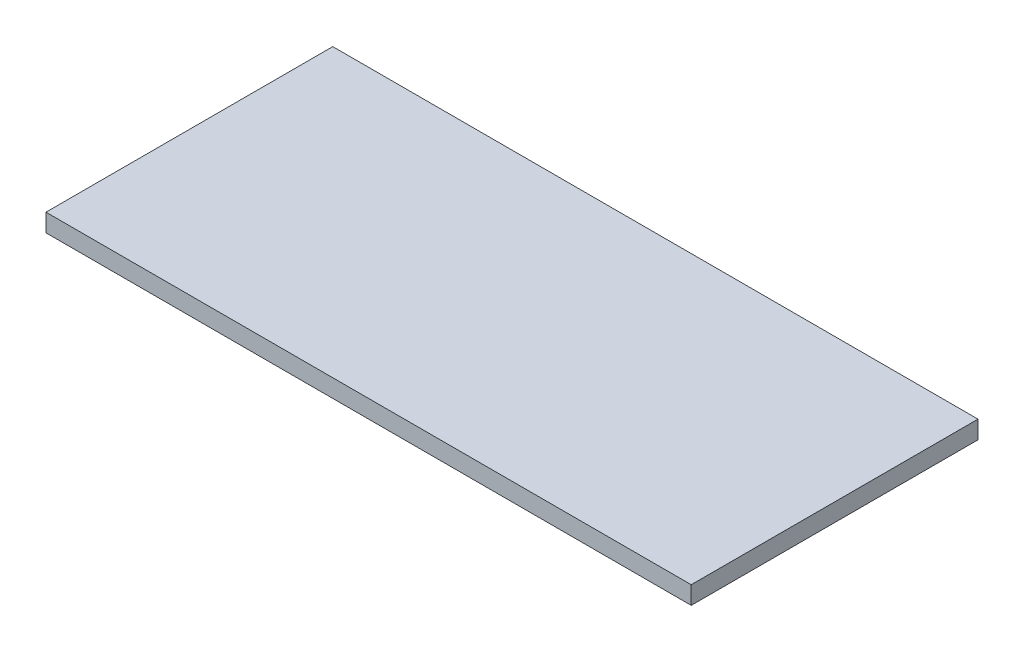
ISO-10303-21;
HEADER;
FILE_DESCRIPTION(('STEP AP214'),'2;1');
FILE_NAME('part.step','',(''),(''),'','','');
FILE_SCHEMA(('AUTOMOTIVE_DESIGN { 1 0 10303 214 1 1 1 1 }'));
ENDSEC;
DATA;
#1=APPLICATION_CONTEXT('core data for automotive mechanical design processes');
#2=APPLICATION_PROTOCOL_DEFINITION('international standard','automotive_design',2000,#1);
#3=PRODUCT_CONTEXT('',#1,'mechanical');
#4=PRODUCT('Part','Part','',(#3));
#5=PRODUCT_RELATED_PRODUCT_CATEGORY('part','',(#4));
#6=PRODUCT_DEFINITION_FORMATION('','',#4);
#7=PRODUCT_DEFINITION_CONTEXT('part definition',#1,'design');
#8=PRODUCT_DEFINITION('design','',#6,#7);
#9=PRODUCT_DEFINITION_SHAPE('','',#8);
#10=(LENGTH_UNIT() NAMED_UNIT(*) SI_UNIT(.MILLI.,.METRE.));
#11=(NAMED_UNIT(*) PLANE_ANGLE_UNIT() SI_UNIT($,.RADIAN.));
#12=(NAMED_UNIT(*) SI_UNIT($,.STERADIAN.) SOLID_ANGLE_UNIT());
#13=UNCERTAINTY_MEASURE_WITH_UNIT(LENGTH_MEASURE(1.E-05),#10,'distance_accuracy_value','');
#14=(GEOMETRIC_REPRESENTATION_CONTEXT(3) GLOBAL_UNCERTAINTY_ASSIGNED_CONTEXT((#13)) GLOBAL_UNIT_ASSIGNED_CONTEXT((#10,
#11,#12)) REPRESENTATION_CONTEXT('',''));
#15=CARTESIAN_POINT('',(0.,0.,0.));
#16=DIRECTION('',(0.,0.,1.));
#17=DIRECTION('',(1.,0.,0.));
#18=AXIS2_PLACEMENT_3D('',#15,#16,#17);
#19=CARTESIAN_POINT('',(-360.,10.,160.));
#20=DIRECTION('',(1.,0.,0.));
#21=DIRECTION('',(0.,0.,-1.));
#22=AXIS2_PLACEMENT_3D('',#19,#20,#21);
#23=PLANE('',#22);
#24=DIRECTION('',(0.,0.,1.));
#25=VECTOR('',#24,1.);
#26=CARTESIAN_POINT('',(-360.,-10.,160.));
#27=LINE('',#26,#25);
#28=CARTESIAN_POINT('',(-360.,-10.,-160.));
#29=VERTEX_POINT('',#28);
#30=CARTESIAN_POINT('',(-360.,-10.,160.));
#31=VERTEX_POINT('',#30);
#32=EDGE_CURVE('E101',#29,#31,#27,.T.);
#33=ORIENTED_EDGE('',*,*,#32,.T.);
#34=DIRECTION('',(0.,-1.,0.));
#35=VECTOR('',#34,1.);
#36=CARTESIAN_POINT('',(-360.,10.,160.));
#37=LINE('',#36,#35);
#38=CARTESIAN_POINT('',(-360.,10.,160.));
#39=VERTEX_POINT('',#38);
#40=EDGE_CURVE('E11',#39,#31,#37,.T.);
#41=ORIENTED_EDGE('',*,*,#40,.F.);
#42=DIRECTION('',(0.,0.,1.));
#43=VECTOR('',#42,1.);
#44=CARTESIAN_POINT('',(-360.,10.,160.));
#45=LINE('',#44,#43);
#46=CARTESIAN_POINT('',(-360.,10.,-160.));
#47=VERTEX_POINT('',#46);
#48=EDGE_CURVE('E89',#47,#39,#45,.T.);
#49=ORIENTED_EDGE('',*,*,#48,.F.);
#50=DIRECTION('',(0.,-1.,0.));
#51=VECTOR('',#50,1.);
#52=CARTESIAN_POINT('',(-360.,10.,-160.));
#53=LINE('',#52,#51);
#54=EDGE_CURVE('E97',#47,#29,#53,.T.);
#55=ORIENTED_EDGE('',*,*,#54,.T.);
#56=EDGE_LOOP('',(#33,#41,#49,#55));
#57=FACE_BOUND('',#56,.T.);
#58=ADVANCED_FACE('F38',(#57),#23,.F.);
#59=CARTESIAN_POINT('',(360.,10.,160.));
#60=DIRECTION('',(0.,0.,-1.));
#61=DIRECTION('',(-1.,0.,0.));
#62=AXIS2_PLACEMENT_3D('',#59,#60,#61);
#63=PLANE('',#62);
#64=DIRECTION('',(1.,0.,0.));
#65=VECTOR('',#64,1.);
#66=CARTESIAN_POINT('',(360.,-10.,160.));
#67=LINE('',#66,#65);
#68=CARTESIAN_POINT('',(360.,-10.,160.));
#69=VERTEX_POINT('',#68);
#70=EDGE_CURVE('E93',#31,#69,#67,.T.);
#71=ORIENTED_EDGE('',*,*,#70,.T.);
#72=DIRECTION('',(0.,-1.,0.));
#73=VECTOR('',#72,1.);
#74=CARTESIAN_POINT('',(360.,10.,160.));
#75=LINE('',#74,#73);
#76=CARTESIAN_POINT('',(360.,10.,160.));
#77=VERTEX_POINT('',#76);
#78=EDGE_CURVE('E46',#77,#69,#75,.T.);
#79=ORIENTED_EDGE('',*,*,#78,.F.);
#80=DIRECTION('',(1.,0.,0.));
#81=VECTOR('',#80,1.);
#82=CARTESIAN_POINT('',(360.,10.,160.));
#83=LINE('',#82,#81);
#84=EDGE_CURVE('E84',#39,#77,#83,.T.);
#85=ORIENTED_EDGE('',*,*,#84,.F.);
#86=ORIENTED_EDGE('',*,*,#40,.T.);
#87=EDGE_LOOP('',(#71,#79,#85,#86));
#88=FACE_BOUND('',#87,.T.);
#89=ADVANCED_FACE('F92',(#88),#63,.F.);
#90=CARTESIAN_POINT('',(360.,10.,160.));
#91=DIRECTION('',(-1.,0.,0.));
#92=DIRECTION('',(0.,0.,1.));
#93=AXIS2_PLACEMENT_3D('',#90,#91,#92);
#94=PLANE('',#93);
#95=DIRECTION('',(0.,0.,-1.));
#96=VECTOR('',#95,1.);
#97=CARTESIAN_POINT('',(360.,-10.,160.));
#98=LINE('',#97,#96);
#99=CARTESIAN_POINT('',(360.,-10.,-160.));
#100=VERTEX_POINT('',#99);
#101=EDGE_CURVE('E71',#69,#100,#98,.T.);
#102=ORIENTED_EDGE('',*,*,#101,.T.);
#103=DIRECTION('',(0.,-1.,0.));
#104=VECTOR('',#103,1.);
#105=CARTESIAN_POINT('',(360.,10.,-160.));
#106=LINE('',#105,#104);
#107=CARTESIAN_POINT('',(360.,10.,-160.));
#108=VERTEX_POINT('',#107);
#109=EDGE_CURVE('E94',#108,#100,#106,.T.);
#110=ORIENTED_EDGE('',*,*,#109,.F.);
#111=DIRECTION('',(0.,0.,-1.));
#112=VECTOR('',#111,1.);
#113=CARTESIAN_POINT('',(360.,10.,160.));
#114=LINE('',#113,#112);
#115=EDGE_CURVE('E87',#77,#108,#114,.T.);
#116=ORIENTED_EDGE('',*,*,#115,.F.);
#117=ORIENTED_EDGE('',*,*,#78,.T.);
#118=EDGE_LOOP('',(#102,#110,#116,#117));
#119=FACE_BOUND('',#118,.T.);
#120=ADVANCED_FACE('F95',(#119),#94,.F.);
#121=CARTESIAN_POINT('',(360.,10.,-160.));
#122=DIRECTION('',(0.,0.,1.));
#123=DIRECTION('',(1.,0.,0.));
#124=AXIS2_PLACEMENT_3D('',#121,#122,#123);
#125=PLANE('',#124);
#126=DIRECTION('',(-1.,0.,0.));
#127=VECTOR('',#126,1.);
#128=CARTESIAN_POINT('',(360.,-10.,-160.));
#129=LINE('',#128,#127);
#130=EDGE_CURVE('E77',#100,#29,#129,.T.);
#131=ORIENTED_EDGE('',*,*,#130,.T.);
#132=ORIENTED_EDGE('',*,*,#54,.F.);
#133=DIRECTION('',(-1.,0.,0.));
#134=VECTOR('',#133,1.);
#135=CARTESIAN_POINT('',(360.,10.,-160.));
#136=LINE('',#135,#134);
#137=EDGE_CURVE('E54',#108,#47,#136,.T.);
#138=ORIENTED_EDGE('',*,*,#137,.F.);
#139=ORIENTED_EDGE('',*,*,#109,.T.);
#140=EDGE_LOOP('',(#131,#132,#138,#139));
#141=FACE_BOUND('',#140,.T.);
#142=ADVANCED_FACE('F108',(#141),#125,.F.);
#143=CARTESIAN_POINT('',(0.,10.,0.));
#144=DIRECTION('',(0.,1.,0.));
#145=DIRECTION('',(0.,0.,1.));
#146=AXIS2_PLACEMENT_3D('',#143,#144,#145);
#147=PLANE('',#146);
#148=ORIENTED_EDGE('',*,*,#48,.T.);
#149=ORIENTED_EDGE('',*,*,#84,.T.);
#150=ORIENTED_EDGE('',*,*,#115,.T.);
#151=ORIENTED_EDGE('',*,*,#137,.T.);
#152=EDGE_LOOP('',(#148,#149,#150,#151));
#153=FACE_BOUND('',#152,.T.);
#154=ADVANCED_FACE('F85',(#153),#147,.T.);
#155=CARTESIAN_POINT('',(0.,-10.,0.));
#156=DIRECTION('',(0.,1.,0.));
#157=DIRECTION('',(0.,0.,1.));
#158=AXIS2_PLACEMENT_3D('',#155,#156,#157);
#159=PLANE('',#158);
#160=ORIENTED_EDGE('',*,*,#32,.F.);
#161=ORIENTED_EDGE('',*,*,#130,.F.);
#162=ORIENTED_EDGE('',*,*,#101,.F.);
#163=ORIENTED_EDGE('',*,*,#70,.F.);
#164=EDGE_LOOP('',(#160,#161,#162,#163));
#165=FACE_BOUND('',#164,.T.);
#166=ADVANCED_FACE('F111',(#165),#159,.F.);
#167=CLOSED_SHELL('',(#58,#89,#120,#142,#154,#166));
#168=MANIFOLD_SOLID_BREP('B2',#167);
#169=ADVANCED_BREP_SHAPE_REPRESENTATION('',(#18,#168),#14);
#170=SHAPE_DEFINITION_REPRESENTATION(#9,#169);
ENDSEC;
END-ISO-10303-21;
